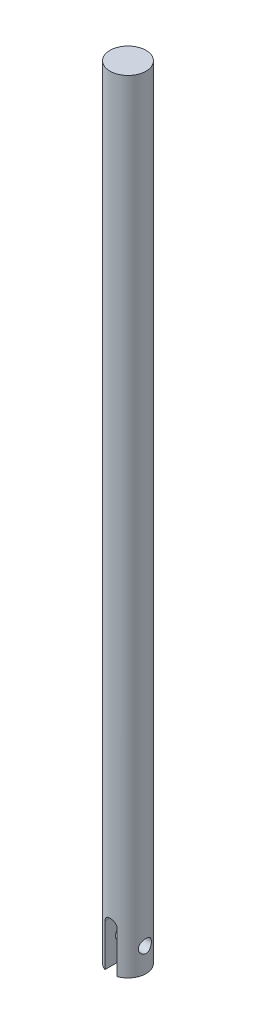
ISO-10303-21;
HEADER;
FILE_DESCRIPTION(('STEP AP214'),'2;1');
FILE_NAME('part.step','',(''),(''),'','','');
FILE_SCHEMA(('AUTOMOTIVE_DESIGN { 1 0 10303 214 1 1 1 1 }'));
ENDSEC;
DATA;
#1=APPLICATION_CONTEXT('core data for automotive mechanical design processes');
#2=APPLICATION_PROTOCOL_DEFINITION('international standard','automotive_design',2000,#1);
#3=PRODUCT_CONTEXT('',#1,'mechanical');
#4=PRODUCT('Part','Part','',(#3));
#5=PRODUCT_RELATED_PRODUCT_CATEGORY('part','',(#4));
#6=PRODUCT_DEFINITION_FORMATION('','',#4);
#7=PRODUCT_DEFINITION_CONTEXT('part definition',#1,'design');
#8=PRODUCT_DEFINITION('design','',#6,#7);
#9=PRODUCT_DEFINITION_SHAPE('','',#8);
#10=(LENGTH_UNIT() NAMED_UNIT(*) SI_UNIT(.MILLI.,.METRE.));
#11=(NAMED_UNIT(*) PLANE_ANGLE_UNIT() SI_UNIT($,.RADIAN.));
#12=(NAMED_UNIT(*) SI_UNIT($,.STERADIAN.) SOLID_ANGLE_UNIT());
#13=UNCERTAINTY_MEASURE_WITH_UNIT(LENGTH_MEASURE(1.E-05),#10,'distance_accuracy_value','');
#14=(GEOMETRIC_REPRESENTATION_CONTEXT(3) GLOBAL_UNCERTAINTY_ASSIGNED_CONTEXT((#13)) GLOBAL_UNIT_ASSIGNED_CONTEXT((#10,
#11,#12)) REPRESENTATION_CONTEXT('',''));
#15=CARTESIAN_POINT('',(0.,0.,0.));
#16=DIRECTION('',(0.,0.,1.));
#17=DIRECTION('',(1.,0.,0.));
#18=AXIS2_PLACEMENT_3D('',#15,#16,#17);
#19=CARTESIAN_POINT('',(0.,0.,0.));
#20=DIRECTION('',(0.,1.,0.));
#21=DIRECTION('',(0.,0.,1.));
#22=AXIS2_PLACEMENT_3D('',#19,#20,#21);
#23=PLANE('',#22);
#24=CARTESIAN_POINT('',(0.,0.,0.));
#25=DIRECTION('',(0.,1.,0.));
#26=DIRECTION('',(0.,0.,1.));
#27=AXIS2_PLACEMENT_3D('',#24,#25,#26);
#28=CIRCLE('',#27,4.7625);
#29=CARTESIAN_POINT('',(-1.58749999999999,0.,-4.49012806053458));
#30=VERTEX_POINT('',#29);
#31=CARTESIAN_POINT('',(-1.58749999999999,0.,4.49012806053458));
#32=VERTEX_POINT('',#31);
#33=EDGE_CURVE('E108',#30,#32,#28,.T.);
#34=ORIENTED_EDGE('',*,*,#33,.F.);
#35=DIRECTION('',(0.,0.,1.));
#36=VECTOR('',#35,1.);
#37=CARTESIAN_POINT('',(-1.58749999999999,0.,0.));
#38=LINE('',#37,#36);
#39=EDGE_CURVE('E115',#30,#32,#38,.T.);
#40=ORIENTED_EDGE('',*,*,#39,.T.);
#41=EDGE_LOOP('',(#34,#40));
#42=FACE_BOUND('',#41,.T.);
#43=ADVANCED_FACE('F35',(#42),#23,.F.);
#44=CARTESIAN_POINT('',(0.,206.375,0.));
#45=DIRECTION('',(0.,-1.,0.));
#46=DIRECTION('',(0.,0.,-1.));
#47=AXIS2_PLACEMENT_3D('',#44,#45,#46);
#48=CYLINDRICAL_SURFACE('',#47,4.7625);
#49=CARTESIAN_POINT('',(-4.7625,4.62280000000001,0.));
#50=CARTESIAN_POINT('',(-4.76250171834447,4.62279764409864,-0.0937545755041915));
#51=CARTESIAN_POINT('',(-4.75970697405948,4.63045787076189,-0.187492537746572));
#52=CARTESIAN_POINT('',(-4.74883616948695,4.66078178677684,-0.372179051588628));
#53=CARTESIAN_POINT('',(-4.7407604845552,4.68344440979788,-0.463127800957489));
#54=CARTESIAN_POINT('',(-4.7201979571911,4.74287432616126,-0.639546381771852));
#55=CARTESIAN_POINT('',(-4.70771928535689,4.77961550479319,-0.72502601746702));
#56=CARTESIAN_POINT('',(-4.67960297548278,4.86603127629626,-0.888605221927853));
#57=CARTESIAN_POINT('',(-4.66396455181959,4.91570908654922,-0.966702948194011));
#58=CARTESIAN_POINT('',(-4.63045168616152,5.02867285018714,-1.11643400456062));
#59=CARTESIAN_POINT('',(-4.61251683817496,5.09238591368294,-1.18773147100918));
#60=CARTESIAN_POINT('',(-4.57674015098026,5.230704670851,-1.3188959429857));
#61=CARTESIAN_POINT('',(-4.55889833896659,5.30531338268449,-1.37875977068728));
#62=CARTESIAN_POINT('',(-4.52463700135302,5.46650738184431,-1.48742500324076));
#63=CARTESIAN_POINT('',(-4.5082894987665,5.55342142905319,-1.53576368249297));
#64=CARTESIAN_POINT('',(-4.47980104480066,5.73483284870226,-1.61698961938085));
#65=CARTESIAN_POINT('',(-4.46765853711715,5.82932739955148,-1.64988259520988));
#66=CARTESIAN_POINT('',(-4.44959767382086,6.01936336609568,-1.69797749038511));
#67=CARTESIAN_POINT('',(-4.44345581754789,6.1147214576579,-1.71381711651929));
#68=CARTESIAN_POINT('',(-4.4374352710222,6.30692463429873,-1.72934980765036));
#69=CARTESIAN_POINT('',(-4.43755420439544,6.40376914123336,-1.7290489989839));
#70=CARTESIAN_POINT('',(-4.44384811377055,6.59048865522154,-1.71279924732252));
#71=CARTESIAN_POINT('',(-4.44968724869642,6.68045255907067,-1.69771806001629));
#72=CARTESIAN_POINT('',(-4.46620813858151,6.85647330243123,-1.65376436768734));
#73=CARTESIAN_POINT('',(-4.47689057535051,6.94252958997574,-1.62488992090506));
#74=CARTESIAN_POINT('',(-4.50210772591773,7.11012243120996,-1.55366551460964));
#75=CARTESIAN_POINT('',(-4.51670873881533,7.19154882491605,-1.51108084761869));
#76=CARTESIAN_POINT('',(-4.54809404564591,7.34635865050662,-1.41380812045635));
#77=CARTESIAN_POINT('',(-4.56487905712762,7.41973942435243,-1.35911607826869));
#78=CARTESIAN_POINT('',(-4.60002246491735,7.56120166415639,-1.23515054513016));
#79=CARTESIAN_POINT('',(-4.61841361301415,7.62866477517503,-1.16517908451571));
#80=CARTESIAN_POINT('',(-4.65378991051254,7.75107635853516,-1.01469862225514));
#81=CARTESIAN_POINT('',(-4.67077487069751,7.80602314841731,-0.934188206237348));
#82=CARTESIAN_POINT('',(-4.70172488258924,7.90246592827436,-0.763420245819675));
#83=CARTESIAN_POINT('',(-4.71564563055729,7.94376843191469,-0.673044833285281));
#84=CARTESIAN_POINT('',(-4.73857256830597,8.01038216421788,-0.485999284012671));
#85=CARTESIAN_POINT('',(-4.74758079364978,8.03570001700123,-0.389331773096013));
#86=CARTESIAN_POINT('',(-4.75931617922052,8.06846583867823,-0.197659749704716));
#87=CARTESIAN_POINT('',(-4.76233603636104,8.07674732613525,-0.102815493160608));
#88=CARTESIAN_POINT('',(-4.76265074022797,8.07761621197069,0.0869438724046496));
#89=CARTESIAN_POINT('',(-4.75994675999552,8.07020682603085,0.181858962924013));
#90=CARTESIAN_POINT('',(-4.74931100003495,8.04054649132318,0.365545840083658));
#91=CARTESIAN_POINT('',(-4.74156792972121,8.01883094715445,0.454416128347594));
#92=CARTESIAN_POINT('',(-4.72182130283949,7.96186869245192,0.627198052222051));
#93=CARTESIAN_POINT('',(-4.70981719224998,7.92662022231503,0.711109041367533));
#94=CARTESIAN_POINT('',(-4.68231719842578,7.84249102059991,0.874274930435864));
#95=CARTESIAN_POINT('',(-4.66673127727808,7.79324927090653,0.953328057011201));
#96=CARTESIAN_POINT('',(-4.63380601545738,7.68294385832264,1.10230592632146));
#97=CARTESIAN_POINT('',(-4.61646605967033,7.62187604129192,1.17222744690551));
#98=CARTESIAN_POINT('',(-4.58078402533572,7.48575241206871,1.30491394288275));
#99=CARTESIAN_POINT('',(-4.5624385518248,7.41011800087169,1.36708593931881));
#100=CARTESIAN_POINT('',(-4.52773988544858,7.24911613010534,1.47795904800678));
#101=CARTESIAN_POINT('',(-4.51138681306805,7.16374808252588,1.52665934582227));
#102=CARTESIAN_POINT('',(-4.48262715523981,6.9852314164515,1.60915598482924));
#103=CARTESIAN_POINT('',(-4.47022831205347,6.89206797937408,1.64292313672782));
#104=CARTESIAN_POINT('',(-4.4510929570739,6.70080803515916,1.69408926902748));
#105=CARTESIAN_POINT('',(-4.44435324730583,6.60271434736873,1.71149749451733));
#106=CARTESIAN_POINT('',(-4.4377059010901,6.41075627635227,1.72865526381664));
#107=CARTESIAN_POINT('',(-4.43741033254274,6.31699413042675,1.72940752835192));
#108=CARTESIAN_POINT('',(-4.4427009187927,6.13075560451232,1.71577013964867));
#109=CARTESIAN_POINT('',(-4.44828658705249,6.03827911880568,1.70138173895319));
#110=CARTESIAN_POINT('',(-4.46439725812017,5.85972803789267,1.65863204862724));
#111=CARTESIAN_POINT('',(-4.47478651136457,5.77354846929137,1.63065377546418));
#112=CARTESIAN_POINT('',(-4.49926303354309,5.60705030438775,1.56184677525983));
#113=CARTESIAN_POINT('',(-4.51335120671582,5.52673314735571,1.52101490553977));
#114=CARTESIAN_POINT('',(-4.54451319020949,5.36988764717713,1.42529173471966));
#115=CARTESIAN_POINT('',(-4.56170088396454,5.29374820568826,1.36980066722247));
#116=CARTESIAN_POINT('',(-4.59670891849956,5.1515401773686,1.24728834299768));
#117=CARTESIAN_POINT('',(-4.61452945225331,5.08547469550135,1.18026354487462));
#118=CARTESIAN_POINT('',(-4.64984991483973,4.96198160298556,1.03263324037725));
#119=CARTESIAN_POINT('',(-4.66729078291507,4.90513999008933,0.951521301887558));
#120=CARTESIAN_POINT('',(-4.69894908939759,4.8059298158121,0.78029152144395));
#121=CARTESIAN_POINT('',(-4.71316662444688,4.76356082049308,0.690173949614113));
#122=CARTESIAN_POINT('',(-4.73694368902278,4.69424242538834,0.501900679624102));
#123=CARTESIAN_POINT('',(-4.7464247096542,4.66755170476659,0.40363909812604));
#124=CARTESIAN_POINT('',(-4.75920062737302,4.63183549764084,0.203577477173884));
#125=CARTESIAN_POINT('',(-4.7624981345839,4.62280255754095,0.101778949190975));
#126=CARTESIAN_POINT('',(-4.7625,4.62280000000001,0.));
#127=B_SPLINE_CURVE_WITH_KNOTS('',3,(#49,#50,#51,#52,#53,#54,#55,#56,#57,#58,#59,#60,#61,#62,
#63,#64,#65,#66,#67,#68,#69,#70,#71,#72,#73,#74,#75,#76,#77,#78,#79,#80,#81,#82,#83,#84,#85,#86,
#87,#88,#89,#90,#91,#92,#93,#94,#95,#96,#97,#98,#99,#100,#101,#102,#103,#104,#105,#106,#107,
#108,#109,#110,#111,#112,#113,#114,#115,#116,#117,#118,#119,#120,#121,#122,#123,#124,#125,#126),
.UNSPECIFIED.,.T.,.F.,(4,2,2,2,2,2,2,2,2,2,2,2,2,2,2,2,2,2,2,2,2,2,2,2,2,2,2,2,2,2,2,2,2,2,2,2,
2,2,4),(0.,0.280888568560705,0.561757174448105,0.842107291718096,1.12252719966266,
1.41308696989151,1.7037273801621,2.00458224645648,2.3053256445179,2.59438406168858,
2.88333276331154,3.15627507377105,3.4292558192793,3.70718323201377,3.98520218895521,
4.28060702184996,4.57605154002564,4.87552186191708,5.1748680001882,5.459182033083,
5.74343780440507,6.01761745219632,6.29183276195998,6.57388985710039,6.85604621068675,
7.15348950144267,7.45095077031254,7.74899093368197,8.04686256106616,8.32674955230263,
8.60661339112527,8.87901088412521,9.1514750295657,9.43753165766334,9.72367627577637,
10.0239198759341,10.3241544729829,10.6292128503899,10.9341424305637),.UNSPECIFIED.);
#128=CARTESIAN_POINT('',(-4.7625,4.62280000000001,0.));
#129=VERTEX_POINT('',#128);
#130=EDGE_CURVE('E11',#129,#129,#127,.T.);
#131=ORIENTED_EDGE('',*,*,#130,.T.);
#132=EDGE_LOOP('',(#131));
#133=FACE_BOUND('',#132,.T.);
#134=CARTESIAN_POINT('',(4.4382638959395,6.35,-1.72719999999999));
#135=CARTESIAN_POINT('',(4.43826170076503,6.25647498980388,-1.72720245273679));
#136=CARTESIAN_POINT('',(4.44125227087206,6.16296673340335,-1.71957825372232));
#137=CARTESIAN_POINT('',(4.45281432649447,5.97875466358787,-1.68941050563445));
#138=CARTESIAN_POINT('',(4.46138594608746,5.88805091760254,-1.66686659813382));
#139=CARTESIAN_POINT('',(4.48301418156908,5.71215457026749,-1.60778321664955));
#140=CARTESIAN_POINT('',(4.49606066132159,5.62695002633721,-1.57127535149555));
#141=CARTESIAN_POINT('',(4.5251527778179,5.46384325013086,-1.48541126703647));
#142=CARTESIAN_POINT('',(4.54119924914203,5.38594305896057,-1.43605147089428));
#143=CARTESIAN_POINT('',(4.57531830276064,5.23603953304191,-1.32342999758052));
#144=CARTESIAN_POINT('',(4.59344781013859,5.1644237622447,-1.25966957164587));
#145=CARTESIAN_POINT('',(4.6292134595369,5.03263092113114,-1.12111687463677));
#146=CARTESIAN_POINT('',(4.64684950425751,4.97245609334432,-1.04632244588852));
#147=CARTESIAN_POINT('',(4.68031233770527,4.86342006832087,-0.884916230268798));
#148=CARTESIAN_POINT('',(4.6960645355822,4.81497547569919,-0.798006168412933));
#149=CARTESIAN_POINT('',(4.723304781633,4.73355301297189,-0.616598609894429));
#150=CARTESIAN_POINT('',(4.73479420578928,4.70057015106069,-0.522103573589333));
#151=CARTESIAN_POINT('',(4.75181055606693,4.6523527578303,-0.332279703113265));
#152=CARTESIAN_POINT('',(4.75756062052196,4.636452013056,-0.237140482332062));
#153=CARTESIAN_POINT('',(4.7632484885006,4.62072059541879,-0.0453819346065162));
#154=CARTESIAN_POINT('',(4.76318806040606,4.62088503323271,0.0512369330673556));
#155=CARTESIAN_POINT('',(4.75740656005228,4.636880665219,0.238455394782947));
#156=CARTESIAN_POINT('',(4.7519478168455,4.65198582695719,0.329126502548623));
#157=CARTESIAN_POINT('',(4.73632258069308,4.69621920680586,0.506546797648018));
#158=CARTESIAN_POINT('',(4.72615575736958,4.72534840902435,0.593295709282353));
#159=CARTESIAN_POINT('',(4.70194903508485,4.79716603644507,0.761867255258715));
#160=CARTESIAN_POINT('',(4.68785619025298,4.84004112273123,0.843602448051954));
#161=CARTESIAN_POINT('',(4.65723624072518,4.93797207017831,0.998915520069439));
#162=CARTESIAN_POINT('',(4.64070838079468,4.99303171312239,1.07249085601079));
#163=CARTESIAN_POINT('',(4.60586004779148,5.11731739807279,1.21368780451131));
#164=CARTESIAN_POINT('',(4.58749097922053,5.18715648202074,1.28075862488537));
#165=CARTESIAN_POINT('',(4.55177029542519,5.33721694100143,1.40243506145783));
#166=CARTESIAN_POINT('',(4.53441890339291,5.41744058124636,1.45703795078784));
#167=CARTESIAN_POINT('',(4.50240377836792,5.58803276059363,1.55318831431884));
#168=CARTESIAN_POINT('',(4.48779931857895,5.67856917415453,1.59445924480795));
#169=CARTESIAN_POINT('',(4.46361535222921,5.86597464045876,1.66096705219198));
#170=CARTESIAN_POINT('',(4.45403326637282,5.96284041388538,1.68621216073413));
#171=CARTESIAN_POINT('',(4.44157966352425,6.15474205010188,1.71873956307094));
#172=CARTESIAN_POINT('',(4.43838397237578,6.249609501934,1.72689070574208));
#173=CARTESIAN_POINT('',(4.43815063581911,6.43938987243235,1.72749177863265));
#174=CARTESIAN_POINT('',(4.44111159028922,6.5343027758545,1.71994527875206));
#175=CARTESIAN_POINT('',(4.45253046050549,6.71718420914205,1.69015114043403));
#176=CARTESIAN_POINT('',(4.46074508377625,6.80527554039076,1.66855346979374));
#177=CARTESIAN_POINT('',(4.48146351831711,6.97655117283182,1.61207609237181));
#178=CARTESIAN_POINT('',(4.49396817339569,7.05973450489221,1.5771937724772));
#179=CARTESIAN_POINT('',(4.52241023957861,7.22214496168185,1.49372582382689));
#180=CARTESIAN_POINT('',(4.53845462567933,7.30112341785869,1.44469384268602));
#181=CARTESIAN_POINT('',(4.57198033021324,7.45004197107227,1.33480249857167));
#182=CARTESIAN_POINT('',(4.58946214321549,7.5199789357742,1.2739390548909));
#183=CARTESIAN_POINT('',(4.62513115095273,7.65307543297262,1.13788812985201));
#184=CARTESIAN_POINT('',(4.6432996606783,7.71559777502578,1.06207032390726));
#185=CARTESIAN_POINT('',(4.6773045937269,7.82709778147632,0.900571093459918));
#186=CARTESIAN_POINT('',(4.69314104297631,7.87607559645853,0.814889778632474));
#187=CARTESIAN_POINT('',(4.72066340402786,7.95872400027347,0.636285986394656));
#188=CARTESIAN_POINT('',(4.73236833332832,7.99246493099547,0.543399153377697));
#189=CARTESIAN_POINT('',(4.75038126613645,8.04366970615501,0.352750974361672));
#190=CARTESIAN_POINT('',(4.75669162193395,8.06114064537755,0.254991772646444));
#191=CARTESIAN_POINT('',(4.76299521092939,8.0785820709106,0.0631529693710933));
#192=CARTESIAN_POINT('',(4.76331614558786,8.07946042766089,-0.0308341067488631));
#193=CARTESIAN_POINT('',(4.75844456752879,8.06599766054947,-0.217556559086099));
#194=CARTESIAN_POINT('',(4.7532526488183,8.05165817640222,-0.310292069068739));
#195=CARTESIAN_POINT('',(4.73808000673232,8.00879571766986,-0.48985343642398));
#196=CARTESIAN_POINT('',(4.72820524248539,7.98058608787763,-0.576763713017683));
#197=CARTESIAN_POINT('',(4.70469111891116,7.91108872682683,-0.744633743801229));
#198=CARTESIAN_POINT('',(4.69105105101021,7.86979853378646,-0.825592374345772));
#199=CARTESIAN_POINT('',(4.66069310838836,7.77339296893058,-0.982864628077255));
#200=CARTESIAN_POINT('',(4.64387256633662,7.71778333450335,-1.05885511954382));
#201=CARTESIAN_POINT('',(4.6092340536962,7.59511476510012,-1.20071184893347));
#202=CARTESIAN_POINT('',(4.59141573871762,7.52805186035272,-1.26657456141552));
#203=CARTESIAN_POINT('',(4.55573955664316,7.38050308174843,-1.38958521655538));
#204=CARTESIAN_POINT('',(4.53792175427281,7.29952365663367,-1.44615494259524));
#205=CARTESIAN_POINT('',(4.50526934573013,7.12864289542013,-1.5448849649361));
#206=CARTESIAN_POINT('',(4.4904346885758,7.03874171183357,-1.58704550749888));
#207=CARTESIAN_POINT('',(4.46545673639148,6.85089988212569,-1.65604477445503));
#208=CARTESIAN_POINT('',(4.45539314541035,6.7528527780841,-1.68262483133596));
#209=CARTESIAN_POINT('',(4.44179970294282,6.55319587485288,-1.71819630529829));
#210=CARTESIAN_POINT('',(4.43826628036588,6.4515880538763,-1.72719733580613));
#211=CARTESIAN_POINT('',(4.4382638959395,6.35,-1.72719999999999));
#212=B_SPLINE_CURVE_WITH_KNOTS('',3,(#134,#135,#136,#137,#138,#139,#140,#141,#142,#143,#144,
#145,#146,#147,#148,#149,#150,#151,#152,#153,#154,#155,#156,#157,#158,#159,#160,#161,#162,#163,
#164,#165,#166,#167,#168,#169,#170,#171,#172,#173,#174,#175,#176,#177,#178,#179,#180,#181,#182,
#183,#184,#185,#186,#187,#188,#189,#190,#191,#192,#193,#194,#195,#196,#197,#198,#199,#200,#201,
#202,#203,#204,#205,#206,#207,#208,#209,#210,#211),.UNSPECIFIED.,.T.,.F.,(4,2,2,2,2,2,2,2,2,2,2,
2,2,2,2,2,2,2,2,2,2,2,2,2,2,2,2,2,2,2,2,2,2,2,2,2,2,2,4),(0.,0.280197377116419,
0.560401485866795,0.839975042418156,1.11962649076282,1.41107897984468,1.7025885375201,
2.00329061840767,2.30389555093067,2.59229594586659,2.88060856848308,3.15556663367876,
3.43054399630026,3.70942590205294,3.98839448751231,4.28272167255983,4.57711316854826,
4.87726856373805,5.17726965939735,5.46161111225914,5.74588790830586,6.0178692264499,
6.28990407143386,6.57168943034088,6.85357215086377,7.15197079247291,7.45036611642389,
7.74736943532118,8.04424318053444,8.32482325988269,8.60537310994206,8.87985756501394,
9.15439370919541,9.44010280878057,9.72591113856105,10.0255929919408,10.3252697233174,
10.6297902525017,10.9341442021331),.UNSPECIFIED.);
#213=CARTESIAN_POINT('',(4.4382638959395,6.35,-1.72719999999999));
#214=VERTEX_POINT('',#213);
#215=EDGE_CURVE('E47',#214,#214,#212,.T.);
#216=ORIENTED_EDGE('',*,*,#215,.T.);
#217=EDGE_LOOP('',(#216));
#218=FACE_BOUND('',#217,.T.);
#219=CARTESIAN_POINT('',(0.,206.375,0.));
#220=DIRECTION('',(0.,1.,0.));
#221=DIRECTION('',(0.,0.,1.));
#222=AXIS2_PLACEMENT_3D('',#219,#220,#221);
#223=CIRCLE('',#222,4.7625);
#224=CARTESIAN_POINT('',(0.,206.375,4.7625));
#225=VERTEX_POINT('',#224);
#226=EDGE_CURVE('E109',#225,#225,#223,.T.);
#227=ORIENTED_EDGE('',*,*,#226,.F.);
#228=EDGE_LOOP('',(#227));
#229=FACE_BOUND('',#228,.T.);
#230=ORIENTED_EDGE('',*,*,#33,.T.);
#231=DIRECTION('',(0.,-1.,0.));
#232=VECTOR('',#231,1.);
#233=CARTESIAN_POINT('',(-1.58750000000002,206.375,4.49012806053457));
#234=LINE('',#233,#232);
#235=CARTESIAN_POINT('',(-1.5875,11.1125,4.49012806053458));
#236=VERTEX_POINT('',#235);
#237=EDGE_CURVE('E62',#32,#236,#234,.F.);
#238=ORIENTED_EDGE('',*,*,#237,.T.);
#239=CARTESIAN_POINT('',(-1.58749999999999,11.1125,4.49012806053458));
#240=CARTESIAN_POINT('',(-1.58750118659147,11.1558236636718,4.49012376824763));
#241=CARTESIAN_POINT('',(-1.58572537278248,11.1991252112256,4.49075587659902));
#242=CARTESIAN_POINT('',(-1.57865065117028,11.2853923771871,4.49324932071638));
#243=CARTESIAN_POINT('',(-1.57335269440071,11.3283580831098,4.49511032466044));
#244=CARTESIAN_POINT('',(-1.55227444692887,11.4560225273223,4.50245308906633));
#245=CARTESIAN_POINT('',(-1.53130921993212,11.5398245934544,4.5096952684298));
#246=CARTESIAN_POINT('',(-1.4763089787808,11.7024549930045,4.52799568584439));
#247=CARTESIAN_POINT('',(-1.4422811768802,11.7812860431608,4.53905181775275));
#248=CARTESIAN_POINT('',(-1.36219125098172,11.9321894864837,4.56372574710894));
#249=CARTESIAN_POINT('',(-1.31612173723109,12.0042576923944,4.57734511612122));
#250=CARTESIAN_POINT('',(-1.21134408721777,12.1423433672277,4.60620237638251));
#251=CARTESIAN_POINT('',(-1.15224715626122,12.2080573727344,4.6214804345719));
#252=CARTESIAN_POINT('',(-1.02391915324897,12.3288520532443,4.65159484800102));
#253=CARTESIAN_POINT('',(-0.954686280480317,12.3839308347938,4.66643112419066));
#254=CARTESIAN_POINT('',(-0.80582078795556,12.4832737361017,4.69445789253336));
#255=CARTESIAN_POINT('',(-0.725963891856605,12.5272180627386,4.70759532129443));
#256=CARTESIAN_POINT('',(-0.559481434320794,12.6009276995535,4.73026753659895));
#257=CARTESIAN_POINT('',(-0.472857950004548,12.6306973411399,4.73980342349379));
#258=CARTESIAN_POINT('',(-0.298496585946378,12.67418046517,4.7539127543939));
#259=CARTESIAN_POINT('',(-0.210902287205422,12.688416445179,4.7586472801936));
#260=CARTESIAN_POINT('',(-0.0344471140108758,12.7020896239094,4.76319228341059));
#261=CARTESIAN_POINT('',(0.0544134536020657,12.7015303488407,4.76300393411568));
#262=CARTESIAN_POINT('',(0.22717735438104,12.6859597005682,4.75783336333485));
#263=CARTESIAN_POINT('',(0.311138415418044,12.6715160622393,4.75303946823631));
#264=CARTESIAN_POINT('',(0.475367452197946,12.6295257971048,4.73943299795057));
#265=CARTESIAN_POINT('',(0.555635222891141,12.6019784437476,4.73062019993148));
#266=CARTESIAN_POINT('',(0.711442289061656,12.534231075759,4.70972623380695));
#267=CARTESIAN_POINT('',(0.786905502725715,12.4938694033683,4.69760360068321));
#268=CARTESIAN_POINT('',(0.930155285192265,12.4017723271673,4.6713519044207));
#269=CARTESIAN_POINT('',(0.997939758172064,12.3500338294637,4.65722229586179));
#270=CARTESIAN_POINT('',(1.12727952679155,12.23379720813,4.62766206709099));
#271=CARTESIAN_POINT('',(1.18839235843516,12.1688136995196,4.61220151154364));
#272=CARTESIAN_POINT('',(1.29900683940236,12.0293741350756,4.58227891125651));
#273=CARTESIAN_POINT('',(1.3485047375543,11.9549150309349,4.56781719016258));
#274=CARTESIAN_POINT('',(1.43510527937854,11.7972202168642,4.54136174809904));
#275=CARTESIAN_POINT('',(1.47201415259345,11.7138711700439,4.52940761230322));
#276=CARTESIAN_POINT('',(1.53108061623802,11.5416854230759,4.50978741585987));
#277=CARTESIAN_POINT('',(1.55326149223788,11.4528576292717,4.50211458936776));
#278=CARTESIAN_POINT('',(1.57425732309581,11.3213854141626,4.49479260575368));
#279=CARTESIAN_POINT('',(1.57922128474249,11.2797567936064,4.49304834965181));
#280=CARTESIAN_POINT('',(1.58584045301302,11.1962595505403,4.49071529419596));
#281=CARTESIAN_POINT('',(1.58749992918953,11.1543913079108,4.49012500388126));
#282=CARTESIAN_POINT('',(1.5875,11.1125,4.49012806053458));
#283=B_SPLINE_CURVE_WITH_KNOTS('',3,(#239,#240,#241,#242,#243,#244,#245,#246,#247,#248,#249,
#250,#251,#252,#253,#254,#255,#256,#257,#258,#259,#260,#261,#262,#263,#264,#265,#266,#267,#268,
#269,#270,#271,#272,#273,#274,#275,#276,#277,#278,#279,#280,#281,#282),.UNSPECIFIED.,.F.,.F.,(4,
2,2,2,2,2,2,2,2,2,2,2,2,2,2,2,2,2,2,2,2,4),(0.,0.129886844517497,0.259738631794021,
0.518447652452654,0.7770140367839,1.0357394721023,1.3035995162825,1.57150720533699,
1.84640748531298,2.12122370904789,2.38648034779751,2.65167376748644,2.90646514314354,
3.16127064766843,3.41942767386223,3.67765499209669,3.94801810817154,4.21846842120671,
4.49291122510762,4.76691908385356,4.89267333840741,5.01826500677375),.UNSPECIFIED.);
#284=CARTESIAN_POINT('',(1.5875,11.1125,4.49012806053458));
#285=VERTEX_POINT('',#284);
#286=EDGE_CURVE('E90',#236,#285,#283,.T.);
#287=ORIENTED_EDGE('',*,*,#286,.T.);
#288=DIRECTION('',(0.,-1.,0.));
#289=VECTOR('',#288,1.);
#290=CARTESIAN_POINT('',(1.58749999999997,206.375,4.49012806053459));
#291=LINE('',#290,#289);
#292=CARTESIAN_POINT('',(1.5875,0.,4.49012806053458));
#293=VERTEX_POINT('',#292);
#294=EDGE_CURVE('E94',#285,#293,#291,.T.);
#295=ORIENTED_EDGE('',*,*,#294,.T.);
#296=CARTESIAN_POINT('',(1.5875,0.,-4.49012806053458));
#297=VERTEX_POINT('',#296);
#298=EDGE_CURVE('E100',#293,#297,#28,.T.);
#299=ORIENTED_EDGE('',*,*,#298,.T.);
#300=DIRECTION('',(0.,-1.,0.));
#301=VECTOR('',#300,1.);
#302=CARTESIAN_POINT('',(1.58749999999997,206.375,-4.49012806053459));
#303=LINE('',#302,#301);
#304=CARTESIAN_POINT('',(1.5875,11.1125,-4.49012806053459));
#305=VERTEX_POINT('',#304);
#306=EDGE_CURVE('E54',#297,#305,#303,.F.);
#307=ORIENTED_EDGE('',*,*,#306,.T.);
#308=CARTESIAN_POINT('',(1.5875,11.1125,-4.49012806053458));
#309=CARTESIAN_POINT('',(1.58750118659148,11.1558236636718,-4.49012376824763));
#310=CARTESIAN_POINT('',(1.58572537278248,11.1991252112256,-4.49075587659902));
#311=CARTESIAN_POINT('',(1.57865065117029,11.2853923771871,-4.49324932071638));
#312=CARTESIAN_POINT('',(1.57335269440072,11.3283580831098,-4.49511032466044));
#313=CARTESIAN_POINT('',(1.55227444692887,11.4560225273223,-4.50245308906633));
#314=CARTESIAN_POINT('',(1.53130921993213,11.5398245934544,-4.5096952684298));
#315=CARTESIAN_POINT('',(1.4763089787808,11.7024549930045,-4.52799568584439));
#316=CARTESIAN_POINT('',(1.44228117688021,11.7812860431608,-4.53905181775275));
#317=CARTESIAN_POINT('',(1.36219125098173,11.9321894864837,-4.56372574710894));
#318=CARTESIAN_POINT('',(1.31612173723109,12.0042576923944,-4.57734511612122));
#319=CARTESIAN_POINT('',(1.21134408721778,12.1423433672277,-4.6062023763825));
#320=CARTESIAN_POINT('',(1.15224715626123,12.2080573727344,-4.6214804345719));
#321=CARTESIAN_POINT('',(1.02391915324898,12.3288520532443,-4.65159484800102));
#322=CARTESIAN_POINT('',(0.954686280480323,12.3839308347938,-4.66643112419066));
#323=CARTESIAN_POINT('',(0.805820787955566,12.4832737361017,-4.69445789253336));
#324=CARTESIAN_POINT('',(0.725963891856611,12.5272180627386,-4.70759532129443));
#325=CARTESIAN_POINT('',(0.5594814343208,12.6009276995535,-4.73026753659895));
#326=CARTESIAN_POINT('',(0.472857950004553,12.6306973411399,-4.73980342349379));
#327=CARTESIAN_POINT('',(0.298496585946383,12.67418046517,-4.7539127543939));
#328=CARTESIAN_POINT('',(0.210902287205427,12.688416445179,-4.7586472801936));
#329=CARTESIAN_POINT('',(0.0344471140108809,12.7020896239094,-4.76319228341059));
#330=CARTESIAN_POINT('',(-0.0544134536020604,12.7015303488407,-4.76300393411567));
#331=CARTESIAN_POINT('',(-0.227177354381035,12.6859597005682,-4.75783336333485));
#332=CARTESIAN_POINT('',(-0.311138415418038,12.6715160622393,-4.75303946823631));
#333=CARTESIAN_POINT('',(-0.47536745219794,12.6295257971048,-4.73943299795057));
#334=CARTESIAN_POINT('',(-0.555635222891135,12.6019784437476,-4.73062019993148));
#335=CARTESIAN_POINT('',(-0.71144228906165,12.534231075759,-4.70972623380695));
#336=CARTESIAN_POINT('',(-0.78690550272571,12.4938694033683,-4.69760360068321));
#337=CARTESIAN_POINT('',(-0.930155285192259,12.4017723271673,-4.6713519044207));
#338=CARTESIAN_POINT('',(-0.997939758172058,12.3500338294636,-4.65722229586179));
#339=CARTESIAN_POINT('',(-1.12727952679154,12.23379720813,-4.62766206709099));
#340=CARTESIAN_POINT('',(-1.18839235843515,12.1688136995196,-4.61220151154364));
#341=CARTESIAN_POINT('',(-1.29900683940235,12.0293741350756,-4.58227891125651));
#342=CARTESIAN_POINT('',(-1.3485047375543,11.9549150309349,-4.56781719016258));
#343=CARTESIAN_POINT('',(-1.43510527937854,11.7972202168642,-4.54136174809904));
#344=CARTESIAN_POINT('',(-1.47201415259344,11.7138711700439,-4.52940761230323));
#345=CARTESIAN_POINT('',(-1.53108061623802,11.5416854230759,-4.50978741585987));
#346=CARTESIAN_POINT('',(-1.55326149223787,11.4528576292717,-4.50211458936776));
#347=CARTESIAN_POINT('',(-1.57425732309581,11.3213854141626,-4.49479260575368));
#348=CARTESIAN_POINT('',(-1.57922128474249,11.2797567936064,-4.49304834965181));
#349=CARTESIAN_POINT('',(-1.58584045301302,11.1962595505403,-4.49071529419596));
#350=CARTESIAN_POINT('',(-1.58749992918952,11.1543913079108,-4.49012500388126));
#351=CARTESIAN_POINT('',(-1.58749999999999,11.1125,-4.49012806053458));
#352=B_SPLINE_CURVE_WITH_KNOTS('',3,(#308,#309,#310,#311,#312,#313,#314,#315,#316,#317,#318,
#319,#320,#321,#322,#323,#324,#325,#326,#327,#328,#329,#330,#331,#332,#333,#334,#335,#336,#337,
#338,#339,#340,#341,#342,#343,#344,#345,#346,#347,#348,#349,#350,#351),.UNSPECIFIED.,.F.,.F.,(4,
2,2,2,2,2,2,2,2,2,2,2,2,2,2,2,2,2,2,2,2,4),(0.,0.129886844517499,0.259738631794021,
0.518447652452654,0.777014036783902,1.0357394721023,1.30359951628251,1.57150720533699,
1.84640748531298,2.12122370904789,2.38648034779751,2.65167376748644,2.90646514314354,
3.16127064766843,3.41942767386223,3.67765499209669,3.94801810817154,4.21846842120671,
4.49291122510762,4.76691908385356,4.89267333840742,5.01826500677375),.UNSPECIFIED.);
#353=CARTESIAN_POINT('',(-1.5875,11.1125,-4.49012806053458));
#354=VERTEX_POINT('',#353);
#355=EDGE_CURVE('E83',#305,#354,#352,.T.);
#356=ORIENTED_EDGE('',*,*,#355,.T.);
#357=DIRECTION('',(0.,-1.,0.));
#358=VECTOR('',#357,1.);
#359=CARTESIAN_POINT('',(-1.58750000000002,206.375,-4.49012806053457));
#360=LINE('',#359,#358);
#361=EDGE_CURVE('E106',#354,#30,#360,.T.);
#362=ORIENTED_EDGE('',*,*,#361,.T.);
#363=EDGE_LOOP('',(#230,#238,#287,#295,#299,#307,#356,#362));
#364=FACE_BOUND('',#363,.T.);
#365=ADVANCED_FACE('F37',(#133,#218,#229,#364),#48,.T.);
#366=CARTESIAN_POINT('',(0.,206.375,0.));
#367=DIRECTION('',(0.,1.,0.));
#368=DIRECTION('',(0.,0.,1.));
#369=AXIS2_PLACEMENT_3D('',#366,#367,#368);
#370=PLANE('',#369);
#371=ORIENTED_EDGE('',*,*,#226,.T.);
#372=EDGE_LOOP('',(#371));
#373=FACE_BOUND('',#372,.T.);
#374=ADVANCED_FACE('F135',(#373),#370,.T.);
#375=ORIENTED_EDGE('',*,*,#298,.F.);
#376=DIRECTION('',(0.,0.,-1.));
#377=VECTOR('',#376,1.);
#378=CARTESIAN_POINT('',(1.5875,0.,0.));
#379=LINE('',#378,#377);
#380=EDGE_CURVE('E112',#293,#297,#379,.T.);
#381=ORIENTED_EDGE('',*,*,#380,.T.);
#382=EDGE_LOOP('',(#375,#381));
#383=FACE_BOUND('',#382,.T.);
#384=ADVANCED_FACE('F129',(#383),#23,.F.);
#385=CARTESIAN_POINT('',(0.,11.1125,-4.7625));
#386=DIRECTION('',(0.,0.,1.));
#387=DIRECTION('',(1.,0.,0.));
#388=AXIS2_PLACEMENT_3D('',#385,#386,#387);
#389=CYLINDRICAL_SURFACE('',#388,1.5875);
#390=DIRECTION('',(0.,0.,1.));
#391=VECTOR('',#390,1.);
#392=CARTESIAN_POINT('',(-1.5875,11.1125,-4.7625));
#393=LINE('',#392,#391);
#394=EDGE_CURVE('E87',#354,#236,#393,.T.);
#395=ORIENTED_EDGE('',*,*,#394,.F.);
#396=ORIENTED_EDGE('',*,*,#355,.F.);
#397=DIRECTION('',(0.,0.,1.));
#398=VECTOR('',#397,1.);
#399=CARTESIAN_POINT('',(1.5875,11.1125,-4.7625));
#400=LINE('',#399,#398);
#401=EDGE_CURVE('E85',#305,#285,#400,.T.);
#402=ORIENTED_EDGE('',*,*,#401,.T.);
#403=ORIENTED_EDGE('',*,*,#286,.F.);
#404=EDGE_LOOP('',(#395,#396,#402,#403));
#405=FACE_BOUND('',#404,.T.);
#406=ADVANCED_FACE('F84',(#405),#389,.F.);
#407=CARTESIAN_POINT('',(-1.58749999999999,-11.1125,-4.7625));
#408=DIRECTION('',(-1.,0.,0.));
#409=DIRECTION('',(0.,-1.,0.));
#410=AXIS2_PLACEMENT_3D('',#407,#408,#409);
#411=PLANE('',#410);
#412=CARTESIAN_POINT('',(-1.5875,6.35,0.));
#413=DIRECTION('',(-1.,0.,0.));
#414=DIRECTION('',(0.,-1.,0.));
#415=AXIS2_PLACEMENT_3D('',#412,#413,#414);
#416=CIRCLE('',#415,1.72719999999999);
#417=CARTESIAN_POINT('',(-1.5875,4.62280000000001,0.));
#418=VERTEX_POINT('',#417);
#419=EDGE_CURVE('E155',#418,#418,#416,.T.);
#420=ORIENTED_EDGE('',*,*,#419,.T.);
#421=EDGE_LOOP('',(#420));
#422=FACE_BOUND('',#421,.T.);
#423=ORIENTED_EDGE('',*,*,#394,.T.);
#424=ORIENTED_EDGE('',*,*,#237,.F.);
#425=ORIENTED_EDGE('',*,*,#39,.F.);
#426=ORIENTED_EDGE('',*,*,#361,.F.);
#427=EDGE_LOOP('',(#423,#424,#425,#426));
#428=FACE_BOUND('',#427,.T.);
#429=ADVANCED_FACE('F128',(#422,#428),#411,.F.);
#430=CARTESIAN_POINT('',(1.5875,-11.1125,-4.7625));
#431=DIRECTION('',(1.,0.,0.));
#432=DIRECTION('',(0.,1.,0.));
#433=AXIS2_PLACEMENT_3D('',#430,#431,#432);
#434=PLANE('',#433);
#435=CARTESIAN_POINT('',(1.5875,6.35,0.));
#436=DIRECTION('',(1.,0.,0.));
#437=DIRECTION('',(0.,1.,0.));
#438=AXIS2_PLACEMENT_3D('',#435,#436,#437);
#439=CIRCLE('',#438,1.72719999999999);
#440=CARTESIAN_POINT('',(1.5875,8.07719999999999,0.));
#441=VERTEX_POINT('',#440);
#442=EDGE_CURVE('E95',#441,#441,#439,.T.);
#443=ORIENTED_EDGE('',*,*,#442,.T.);
#444=EDGE_LOOP('',(#443));
#445=FACE_BOUND('',#444,.T.);
#446=ORIENTED_EDGE('',*,*,#401,.F.);
#447=ORIENTED_EDGE('',*,*,#306,.F.);
#448=ORIENTED_EDGE('',*,*,#380,.F.);
#449=ORIENTED_EDGE('',*,*,#294,.F.);
#450=EDGE_LOOP('',(#446,#447,#448,#449));
#451=FACE_BOUND('',#450,.T.);
#452=ADVANCED_FACE('F92',(#445,#451),#434,.F.);
#453=CARTESIAN_POINT('',(4.7625,6.35,0.));
#454=DIRECTION('',(1.,0.,0.));
#455=DIRECTION('',(0.,0.,-1.));
#456=AXIS2_PLACEMENT_3D('',#453,#454,#455);
#457=CYLINDRICAL_SURFACE('',#456,1.72719999999999);
#458=ORIENTED_EDGE('',*,*,#215,.F.);
#459=EDGE_LOOP('',(#458));
#460=FACE_BOUND('',#459,.T.);
#461=ORIENTED_EDGE('',*,*,#442,.F.);
#462=EDGE_LOOP('',(#461));
#463=FACE_BOUND('',#462,.T.);
#464=ADVANCED_FACE('F133',(#460,#463),#457,.F.);
#465=ORIENTED_EDGE('',*,*,#130,.F.);
#466=EDGE_LOOP('',(#465));
#467=FACE_BOUND('',#466,.T.);
#468=ORIENTED_EDGE('',*,*,#419,.F.);
#469=EDGE_LOOP('',(#468));
#470=FACE_BOUND('',#469,.T.);
#471=ADVANCED_FACE('F163',(#467,#470),#457,.F.);
#472=CLOSED_SHELL('',(#43,#365,#374,#384,#406,#429,#452,#464,#471));
#473=MANIFOLD_SOLID_BREP('B2',#472);
#474=ADVANCED_BREP_SHAPE_REPRESENTATION('',(#18,#473),#14);
#475=SHAPE_DEFINITION_REPRESENTATION(#9,#474);
ENDSEC;
END-ISO-10303-21;
